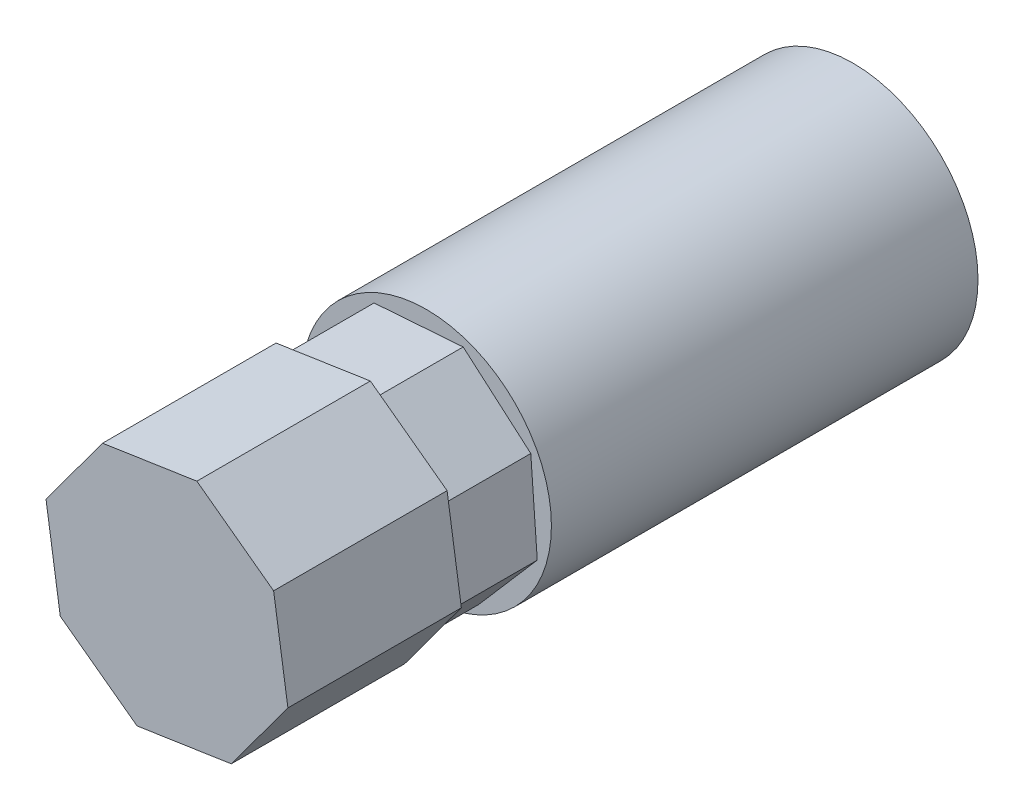
ISO-10303-21;
HEADER;
FILE_DESCRIPTION(('STEP AP214'),'2;1');
FILE_NAME('part.step','',(''),(''),'','','');
FILE_SCHEMA(('AUTOMOTIVE_DESIGN { 1 0 10303 214 1 1 1 1 }'));
ENDSEC;
DATA;
#1=APPLICATION_CONTEXT('core data for automotive mechanical design processes');
#2=APPLICATION_PROTOCOL_DEFINITION('international standard','automotive_design',2000,#1);
#3=PRODUCT_CONTEXT('',#1,'mechanical');
#4=PRODUCT('Part','Part','',(#3));
#5=PRODUCT_RELATED_PRODUCT_CATEGORY('part','',(#4));
#6=PRODUCT_DEFINITION_FORMATION('','',#4);
#7=PRODUCT_DEFINITION_CONTEXT('part definition',#1,'design');
#8=PRODUCT_DEFINITION('design','',#6,#7);
#9=PRODUCT_DEFINITION_SHAPE('','',#8);
#10=(LENGTH_UNIT() NAMED_UNIT(*) SI_UNIT(.MILLI.,.METRE.));
#11=(NAMED_UNIT(*) PLANE_ANGLE_UNIT() SI_UNIT($,.RADIAN.));
#12=(NAMED_UNIT(*) SI_UNIT($,.STERADIAN.) SOLID_ANGLE_UNIT());
#13=UNCERTAINTY_MEASURE_WITH_UNIT(LENGTH_MEASURE(1.E-05),#10,'distance_accuracy_value','');
#14=(GEOMETRIC_REPRESENTATION_CONTEXT(3) GLOBAL_UNCERTAINTY_ASSIGNED_CONTEXT((#13)) GLOBAL_UNIT_ASSIGNED_CONTEXT((#10,
#11,#12)) REPRESENTATION_CONTEXT('',''));
#15=CARTESIAN_POINT('',(0.,0.,0.));
#16=DIRECTION('',(0.,0.,1.));
#17=DIRECTION('',(1.,0.,0.));
#18=AXIS2_PLACEMENT_3D('',#15,#16,#17);
#19=CARTESIAN_POINT('',(0.,0.,15.367));
#20=DIRECTION('',(0.,0.,1.));
#21=DIRECTION('',(1.,0.,0.));
#22=AXIS2_PLACEMENT_3D('',#19,#20,#21);
#23=PLANE('',#22);
#24=CARTESIAN_POINT('',(0.,0.,15.367));
#25=DIRECTION('',(0.,0.,1.));
#26=DIRECTION('',(1.,0.,0.));
#27=AXIS2_PLACEMENT_3D('',#24,#25,#26);
#28=CIRCLE('',#27,4.50215);
#29=CARTESIAN_POINT('',(4.50215,0.,15.367));
#30=VERTEX_POINT('',#29);
#31=EDGE_CURVE('E11',#30,#30,#28,.T.);
#32=ORIENTED_EDGE('',*,*,#31,.T.);
#33=EDGE_LOOP('',(#32));
#34=FACE_BOUND('',#33,.T.);
#35=DIRECTION('',(-0.654043060694388,-0.756457318529947,0.));
#36=VECTOR('',#35,1.);
#37=CARTESIAN_POINT('',(-1.88692036380454,3.75942415581379,15.367));
#38=LINE('',#37,#36);
#39=CARTESIAN_POINT('',(-1.88692036380454,3.75942415581379,15.367));
#40=VERTEX_POINT('',#39);
#41=CARTESIAN_POINT('',(-3.99256849873762,1.32406012912727,15.367));
#42=VERTEX_POINT('',#41);
#43=EDGE_CURVE('E143',#40,#42,#38,.T.);
#44=ORIENTED_EDGE('',*,*,#43,.F.);
#45=DIRECTION('',(-0.997374383015724,-0.072417816205711,0.));
#46=VECTOR('',#45,1.);
#47=CARTESIAN_POINT('',(1.32406012912727,3.99256849873762,15.367));
#48=LINE('',#47,#46);
#49=CARTESIAN_POINT('',(1.32406012912727,3.99256849873762,15.367));
#50=VERTEX_POINT('',#49);
#51=EDGE_CURVE('E140',#50,#40,#48,.T.);
#52=ORIENTED_EDGE('',*,*,#51,.F.);
#53=DIRECTION('',(-0.756457318529947,0.654043060694388,0.));
#54=VECTOR('',#53,1.);
#55=CARTESIAN_POINT('',(3.75942415581379,1.88692036380454,15.367));
#56=LINE('',#55,#54);
#57=CARTESIAN_POINT('',(3.75942415581379,1.88692036380454,15.367));
#58=VERTEX_POINT('',#57);
#59=EDGE_CURVE('E81',#58,#50,#56,.T.);
#60=ORIENTED_EDGE('',*,*,#59,.F.);
#61=DIRECTION('',(-0.0724178162057107,0.997374383015724,0.));
#62=VECTOR('',#61,1.);
#63=CARTESIAN_POINT('',(3.99256849873762,-1.32406012912727,15.367));
#64=LINE('',#63,#62);
#65=CARTESIAN_POINT('',(3.99256849873762,-1.32406012912727,15.367));
#66=VERTEX_POINT('',#65);
#67=EDGE_CURVE('E153',#66,#58,#64,.T.);
#68=ORIENTED_EDGE('',*,*,#67,.F.);
#69=DIRECTION('',(0.654043060694388,0.756457318529947,0.));
#70=VECTOR('',#69,1.);
#71=CARTESIAN_POINT('',(1.88692036380454,-3.75942415581379,15.367));
#72=LINE('',#71,#70);
#73=CARTESIAN_POINT('',(1.88692036380454,-3.75942415581379,15.367));
#74=VERTEX_POINT('',#73);
#75=EDGE_CURVE('E151',#74,#66,#72,.T.);
#76=ORIENTED_EDGE('',*,*,#75,.F.);
#77=DIRECTION('',(0.997374383015724,0.0724178162057111,0.));
#78=VECTOR('',#77,1.);
#79=CARTESIAN_POINT('',(-1.32406012912727,-3.99256849873762,15.367));
#80=LINE('',#79,#78);
#81=CARTESIAN_POINT('',(-1.32406012912727,-3.99256849873762,15.367));
#82=VERTEX_POINT('',#81);
#83=EDGE_CURVE('E112',#82,#74,#80,.T.);
#84=ORIENTED_EDGE('',*,*,#83,.F.);
#85=DIRECTION('',(0.756457318529947,-0.654043060694388,0.));
#86=VECTOR('',#85,1.);
#87=CARTESIAN_POINT('',(-3.75942415581379,-1.88692036380454,15.367));
#88=LINE('',#87,#86);
#89=CARTESIAN_POINT('',(-3.75942415581379,-1.88692036380454,15.367));
#90=VERTEX_POINT('',#89);
#91=EDGE_CURVE('E148',#90,#82,#88,.T.);
#92=ORIENTED_EDGE('',*,*,#91,.F.);
#93=DIRECTION('',(0.0724178162057112,-0.997374383015724,0.));
#94=VECTOR('',#93,1.);
#95=CARTESIAN_POINT('',(-3.99256849873762,1.32406012912727,15.367));
#96=LINE('',#95,#94);
#97=EDGE_CURVE('E146',#42,#90,#96,.T.);
#98=ORIENTED_EDGE('',*,*,#97,.F.);
#99=EDGE_LOOP('',(#44,#52,#60,#68,#76,#84,#92,#98));
#100=FACE_BOUND('',#99,.T.);
#101=ADVANCED_FACE('F33',(#34,#100),#23,.T.);
#102=CARTESIAN_POINT('',(0.,0.,0.));
#103=DIRECTION('',(0.,0.,1.));
#104=DIRECTION('',(1.,0.,0.));
#105=AXIS2_PLACEMENT_3D('',#102,#103,#104);
#106=PLANE('',#105);
#107=CARTESIAN_POINT('',(0.,0.,0.));
#108=DIRECTION('',(0.,0.,1.));
#109=DIRECTION('',(1.,0.,0.));
#110=AXIS2_PLACEMENT_3D('',#107,#108,#109);
#111=CIRCLE('',#110,4.50215);
#112=CARTESIAN_POINT('',(4.50215,0.,0.));
#113=VERTEX_POINT('',#112);
#114=EDGE_CURVE('E37',#113,#113,#111,.T.);
#115=ORIENTED_EDGE('',*,*,#114,.F.);
#116=EDGE_LOOP('',(#115));
#117=FACE_BOUND('',#116,.T.);
#118=CARTESIAN_POINT('',(0.,0.,0.));
#119=DIRECTION('',(0.,0.,1.));
#120=DIRECTION('',(1.,0.,0.));
#121=AXIS2_PLACEMENT_3D('',#118,#119,#120);
#122=CIRCLE('',#121,3.1115);
#123=CARTESIAN_POINT('',(3.1115,0.,0.));
#124=VERTEX_POINT('',#123);
#125=EDGE_CURVE('E172',#124,#124,#122,.T.);
#126=ORIENTED_EDGE('',*,*,#125,.T.);
#127=EDGE_LOOP('',(#126));
#128=FACE_BOUND('',#127,.T.);
#129=ADVANCED_FACE('F180',(#117,#128),#106,.F.);
#130=CARTESIAN_POINT('',(0.,0.,15.367));
#131=DIRECTION('',(0.,0.,-1.));
#132=DIRECTION('',(-1.,0.,0.));
#133=AXIS2_PLACEMENT_3D('',#130,#131,#132);
#134=CYLINDRICAL_SURFACE('',#133,4.50215);
#135=ORIENTED_EDGE('',*,*,#31,.F.);
#136=EDGE_LOOP('',(#135));
#137=FACE_BOUND('',#136,.T.);
#138=ORIENTED_EDGE('',*,*,#114,.T.);
#139=EDGE_LOOP('',(#138));
#140=FACE_BOUND('',#139,.T.);
#141=ADVANCED_FACE('F35',(#137,#140),#134,.T.);
#142=CARTESIAN_POINT('',(0.,0.,15.367));
#143=DIRECTION('',(0.,0.,-1.));
#144=DIRECTION('',(-1.,0.,0.));
#145=AXIS2_PLACEMENT_3D('',#142,#143,#144);
#146=CYLINDRICAL_SURFACE('',#145,3.1115);
#147=CARTESIAN_POINT('',(0.,0.,15.367));
#148=DIRECTION('',(0.,0.,1.));
#149=DIRECTION('',(1.,0.,0.));
#150=AXIS2_PLACEMENT_3D('',#147,#148,#149);
#151=CIRCLE('',#150,3.1115);
#152=CARTESIAN_POINT('',(3.1115,0.,15.367));
#153=VERTEX_POINT('',#152);
#154=EDGE_CURVE('E169',#153,#153,#151,.T.);
#155=ORIENTED_EDGE('',*,*,#154,.T.);
#156=EDGE_LOOP('',(#155));
#157=FACE_BOUND('',#156,.T.);
#158=ORIENTED_EDGE('',*,*,#125,.F.);
#159=EDGE_LOOP('',(#158));
#160=FACE_BOUND('',#159,.T.);
#161=ADVANCED_FACE('F186',(#157,#160),#146,.F.);
#162=CARTESIAN_POINT('',(0.,0.,15.367));
#163=DIRECTION('',(0.,0.,1.));
#164=DIRECTION('',(1.,0.,0.));
#165=AXIS2_PLACEMENT_3D('',#162,#163,#164);
#166=PLANE('',#165);
#167=ORIENTED_EDGE('',*,*,#154,.F.);
#168=EDGE_LOOP('',(#167));
#169=FACE_BOUND('',#168,.T.);
#170=ADVANCED_FACE('F193',(#169),#166,.F.);
#171=CARTESIAN_POINT('',(1.32406012912727,3.99256849873762,18.4658));
#172=DIRECTION('',(0.072417816205711,-0.997374383015724,0.));
#173=DIRECTION('',(0.997374383015724,0.072417816205711,0.));
#174=AXIS2_PLACEMENT_3D('',#171,#172,#173);
#175=PLANE('',#174);
#176=ORIENTED_EDGE('',*,*,#51,.T.);
#177=DIRECTION('',(0.,0.,-1.));
#178=VECTOR('',#177,1.);
#179=CARTESIAN_POINT('',(-1.88692036380454,3.75942415581379,18.4658));
#180=LINE('',#179,#178);
#181=CARTESIAN_POINT('',(-1.88692036380454,3.75942415581379,18.4658));
#182=VERTEX_POINT('',#181);
#183=EDGE_CURVE('E167',#182,#40,#180,.T.);
#184=ORIENTED_EDGE('',*,*,#183,.F.);
#185=DIRECTION('',(-0.997374383015724,-0.072417816205711,0.));
#186=VECTOR('',#185,1.);
#187=CARTESIAN_POINT('',(1.32406012912727,3.99256849873762,18.4658));
#188=LINE('',#187,#186);
#189=CARTESIAN_POINT('',(1.32406012912727,3.99256849873762,18.4658));
#190=VERTEX_POINT('',#189);
#191=EDGE_CURVE('E156',#190,#182,#188,.T.);
#192=ORIENTED_EDGE('',*,*,#191,.F.);
#193=DIRECTION('',(0.,0.,-1.));
#194=VECTOR('',#193,1.);
#195=CARTESIAN_POINT('',(1.32406012912727,3.99256849873762,18.4658));
#196=LINE('',#195,#194);
#197=EDGE_CURVE('E139',#190,#50,#196,.T.);
#198=ORIENTED_EDGE('',*,*,#197,.T.);
#199=EDGE_LOOP('',(#176,#184,#192,#198));
#200=FACE_BOUND('',#199,.T.);
#201=ADVANCED_FACE('F195',(#200),#175,.F.);
#202=CARTESIAN_POINT('',(-1.88692036380454,3.75942415581379,18.4658));
#203=DIRECTION('',(0.756457318529947,-0.654043060694388,0.));
#204=DIRECTION('',(0.654043060694388,0.756457318529947,0.));
#205=AXIS2_PLACEMENT_3D('',#202,#203,#204);
#206=PLANE('',#205);
#207=ORIENTED_EDGE('',*,*,#43,.T.);
#208=DIRECTION('',(0.,0.,-1.));
#209=VECTOR('',#208,1.);
#210=CARTESIAN_POINT('',(-3.99256849873762,1.32406012912727,18.4658));
#211=LINE('',#210,#209);
#212=CARTESIAN_POINT('',(-3.99256849873762,1.32406012912727,18.4658));
#213=VERTEX_POINT('',#212);
#214=EDGE_CURVE('E164',#213,#42,#211,.T.);
#215=ORIENTED_EDGE('',*,*,#214,.F.);
#216=DIRECTION('',(-0.654043060694388,-0.756457318529947,0.));
#217=VECTOR('',#216,1.);
#218=CARTESIAN_POINT('',(-1.88692036380454,3.75942415581379,18.4658));
#219=LINE('',#218,#217);
#220=EDGE_CURVE('E89',#182,#213,#219,.T.);
#221=ORIENTED_EDGE('',*,*,#220,.F.);
#222=ORIENTED_EDGE('',*,*,#183,.T.);
#223=EDGE_LOOP('',(#207,#215,#221,#222));
#224=FACE_BOUND('',#223,.T.);
#225=ADVANCED_FACE('F198',(#224),#206,.F.);
#226=CARTESIAN_POINT('',(-3.99256849873762,1.32406012912727,18.4658));
#227=DIRECTION('',(0.997374383015724,0.0724178162057113,0.));
#228=DIRECTION('',(-0.0724178162057113,0.997374383015724,0.));
#229=AXIS2_PLACEMENT_3D('',#226,#227,#228);
#230=PLANE('',#229);
#231=ORIENTED_EDGE('',*,*,#97,.T.);
#232=DIRECTION('',(0.,0.,-1.));
#233=VECTOR('',#232,1.);
#234=CARTESIAN_POINT('',(-3.75942415581379,-1.88692036380454,18.4658));
#235=LINE('',#234,#233);
#236=CARTESIAN_POINT('',(-3.75942415581379,-1.88692036380454,18.4658));
#237=VERTEX_POINT('',#236);
#238=EDGE_CURVE('E161',#237,#90,#235,.T.);
#239=ORIENTED_EDGE('',*,*,#238,.F.);
#240=DIRECTION('',(0.0724178162057112,-0.997374383015724,0.));
#241=VECTOR('',#240,1.);
#242=CARTESIAN_POINT('',(-3.99256849873762,1.32406012912727,18.4658));
#243=LINE('',#242,#241);
#244=EDGE_CURVE('E132',#213,#237,#243,.T.);
#245=ORIENTED_EDGE('',*,*,#244,.F.);
#246=ORIENTED_EDGE('',*,*,#214,.T.);
#247=EDGE_LOOP('',(#231,#239,#245,#246));
#248=FACE_BOUND('',#247,.T.);
#249=ADVANCED_FACE('F202',(#248),#230,.F.);
#250=CARTESIAN_POINT('',(-3.75942415581379,-1.88692036380454,18.4658));
#251=DIRECTION('',(0.654043060694388,0.756457318529947,0.));
#252=DIRECTION('',(-0.756457318529947,0.654043060694388,0.));
#253=AXIS2_PLACEMENT_3D('',#250,#251,#252);
#254=PLANE('',#253);
#255=ORIENTED_EDGE('',*,*,#91,.T.);
#256=DIRECTION('',(0.,0.,-1.));
#257=VECTOR('',#256,1.);
#258=CARTESIAN_POINT('',(-1.32406012912727,-3.99256849873762,18.4658));
#259=LINE('',#258,#257);
#260=CARTESIAN_POINT('',(-1.32406012912727,-3.99256849873762,18.4658));
#261=VERTEX_POINT('',#260);
#262=EDGE_CURVE('E115',#261,#82,#259,.T.);
#263=ORIENTED_EDGE('',*,*,#262,.F.);
#264=DIRECTION('',(0.756457318529947,-0.654043060694388,0.));
#265=VECTOR('',#264,1.);
#266=CARTESIAN_POINT('',(-3.75942415581379,-1.88692036380454,18.4658));
#267=LINE('',#266,#265);
#268=EDGE_CURVE('E130',#237,#261,#267,.T.);
#269=ORIENTED_EDGE('',*,*,#268,.F.);
#270=ORIENTED_EDGE('',*,*,#238,.T.);
#271=EDGE_LOOP('',(#255,#263,#269,#270));
#272=FACE_BOUND('',#271,.T.);
#273=ADVANCED_FACE('F205',(#272),#254,.F.);
#274=CARTESIAN_POINT('',(-1.32406012912727,-3.99256849873762,18.4658));
#275=DIRECTION('',(-0.0724178162057111,0.997374383015724,0.));
#276=DIRECTION('',(-0.997374383015724,-0.0724178162057111,0.));
#277=AXIS2_PLACEMENT_3D('',#274,#275,#276);
#278=PLANE('',#277);
#279=ORIENTED_EDGE('',*,*,#83,.T.);
#280=DIRECTION('',(0.,0.,-1.));
#281=VECTOR('',#280,1.);
#282=CARTESIAN_POINT('',(1.88692036380454,-3.75942415581379,18.4658));
#283=LINE('',#282,#281);
#284=CARTESIAN_POINT('',(1.88692036380454,-3.75942415581379,18.4658));
#285=VERTEX_POINT('',#284);
#286=EDGE_CURVE('E104',#285,#74,#283,.T.);
#287=ORIENTED_EDGE('',*,*,#286,.F.);
#288=DIRECTION('',(0.997374383015724,0.0724178162057111,0.));
#289=VECTOR('',#288,1.);
#290=CARTESIAN_POINT('',(-1.32406012912727,-3.99256849873762,18.4658));
#291=LINE('',#290,#289);
#292=EDGE_CURVE('E109',#261,#285,#291,.T.);
#293=ORIENTED_EDGE('',*,*,#292,.F.);
#294=ORIENTED_EDGE('',*,*,#262,.T.);
#295=EDGE_LOOP('',(#279,#287,#293,#294));
#296=FACE_BOUND('',#295,.T.);
#297=ADVANCED_FACE('F106',(#296),#278,.F.);
#298=CARTESIAN_POINT('',(1.88692036380454,-3.75942415581379,18.4658));
#299=DIRECTION('',(-0.756457318529947,0.654043060694388,0.));
#300=DIRECTION('',(-0.654043060694388,-0.756457318529947,0.));
#301=AXIS2_PLACEMENT_3D('',#298,#299,#300);
#302=PLANE('',#301);
#303=ORIENTED_EDGE('',*,*,#75,.T.);
#304=DIRECTION('',(0.,0.,-1.));
#305=VECTOR('',#304,1.);
#306=CARTESIAN_POINT('',(3.99256849873762,-1.32406012912727,18.4658));
#307=LINE('',#306,#305);
#308=CARTESIAN_POINT('',(3.99256849873762,-1.32406012912727,18.4658));
#309=VERTEX_POINT('',#308);
#310=EDGE_CURVE('E116',#309,#66,#307,.T.);
#311=ORIENTED_EDGE('',*,*,#310,.F.);
#312=DIRECTION('',(0.654043060694388,0.756457318529947,0.));
#313=VECTOR('',#312,1.);
#314=CARTESIAN_POINT('',(1.88692036380454,-3.75942415581379,18.4658));
#315=LINE('',#314,#313);
#316=EDGE_CURVE('E119',#285,#309,#315,.T.);
#317=ORIENTED_EDGE('',*,*,#316,.F.);
#318=ORIENTED_EDGE('',*,*,#286,.T.);
#319=EDGE_LOOP('',(#303,#311,#317,#318));
#320=FACE_BOUND('',#319,.T.);
#321=ADVANCED_FACE('F120',(#320),#302,.F.);
#322=CARTESIAN_POINT('',(3.99256849873762,-1.32406012912727,18.4658));
#323=DIRECTION('',(-0.997374383015724,-0.0724178162057107,0.));
#324=DIRECTION('',(0.0724178162057107,-0.997374383015724,0.));
#325=AXIS2_PLACEMENT_3D('',#322,#323,#324);
#326=PLANE('',#325);
#327=ORIENTED_EDGE('',*,*,#67,.T.);
#328=DIRECTION('',(0.,0.,-1.));
#329=VECTOR('',#328,1.);
#330=CARTESIAN_POINT('',(3.75942415581379,1.88692036380454,18.4658));
#331=LINE('',#330,#329);
#332=CARTESIAN_POINT('',(3.75942415581379,1.88692036380454,18.4658));
#333=VERTEX_POINT('',#332);
#334=EDGE_CURVE('E48',#333,#58,#331,.T.);
#335=ORIENTED_EDGE('',*,*,#334,.F.);
#336=DIRECTION('',(-0.0724178162057107,0.997374383015724,0.));
#337=VECTOR('',#336,1.);
#338=CARTESIAN_POINT('',(3.99256849873762,-1.32406012912727,18.4658));
#339=LINE('',#338,#337);
#340=EDGE_CURVE('E124',#309,#333,#339,.T.);
#341=ORIENTED_EDGE('',*,*,#340,.F.);
#342=ORIENTED_EDGE('',*,*,#310,.T.);
#343=EDGE_LOOP('',(#327,#335,#341,#342));
#344=FACE_BOUND('',#343,.T.);
#345=ADVANCED_FACE('F214',(#344),#326,.F.);
#346=CARTESIAN_POINT('',(3.75942415581379,1.88692036380454,18.4658));
#347=DIRECTION('',(-0.654043060694388,-0.756457318529947,0.));
#348=DIRECTION('',(0.756457318529947,-0.654043060694388,0.));
#349=AXIS2_PLACEMENT_3D('',#346,#347,#348);
#350=PLANE('',#349);
#351=ORIENTED_EDGE('',*,*,#59,.T.);
#352=ORIENTED_EDGE('',*,*,#197,.F.);
#353=DIRECTION('',(-0.756457318529947,0.654043060694388,0.));
#354=VECTOR('',#353,1.);
#355=CARTESIAN_POINT('',(3.75942415581379,1.88692036380454,18.4658));
#356=LINE('',#355,#354);
#357=EDGE_CURVE('E137',#333,#190,#356,.T.);
#358=ORIENTED_EDGE('',*,*,#357,.F.);
#359=ORIENTED_EDGE('',*,*,#334,.T.);
#360=EDGE_LOOP('',(#351,#352,#358,#359));
#361=FACE_BOUND('',#360,.T.);
#362=ADVANCED_FACE('F217',(#361),#350,.F.);
#363=CARTESIAN_POINT('',(0.,0.,18.4658));
#364=DIRECTION('',(0.,0.,1.));
#365=DIRECTION('',(1.,0.,0.));
#366=AXIS2_PLACEMENT_3D('',#363,#364,#365);
#367=PLANE('',#366);
#368=DIRECTION('',(-0.98875069559291,-0.149572931924654,0.));
#369=VECTOR('',#368,1.);
#370=CARTESIAN_POINT('',(1.07802428187722,4.35680427000171,18.4658));
#371=LINE('',#370,#369);
#372=CARTESIAN_POINT('',(1.07802428187722,4.35680427000171,18.4658));
#373=VERTEX_POINT('',#372);
#374=CARTESIAN_POINT('',(-2.31844756362157,3.84300412361985,18.4658));
#375=VERTEX_POINT('',#374);
#376=EDGE_CURVE('E289',#373,#375,#371,.T.);
#377=ORIENTED_EDGE('',*,*,#376,.F.);
#378=DIRECTION('',(-0.804916356202539,0.593388287310785,0.));
#379=VECTOR('',#378,1.);
#380=CARTESIAN_POINT('',(3.84300412361985,2.31844756362157,18.4658));
#381=LINE('',#380,#379);
#382=CARTESIAN_POINT('',(3.84300412361985,2.31844756362157,18.4658));
#383=VERTEX_POINT('',#382);
#384=EDGE_CURVE('E283',#383,#373,#381,.T.);
#385=ORIENTED_EDGE('',*,*,#384,.F.);
#386=DIRECTION('',(-0.149572931924655,0.98875069559291,0.));
#387=VECTOR('',#386,1.);
#388=CARTESIAN_POINT('',(4.35680427000171,-1.07802428187722,18.4658));
#389=LINE('',#388,#387);
#390=CARTESIAN_POINT('',(4.35680427000171,-1.07802428187722,18.4658));
#391=VERTEX_POINT('',#390);
#392=EDGE_CURVE('E339',#391,#383,#389,.T.);
#393=ORIENTED_EDGE('',*,*,#392,.F.);
#394=DIRECTION('',(0.593388287310786,0.804916356202539,0.));
#395=VECTOR('',#394,1.);
#396=CARTESIAN_POINT('',(2.31844756362157,-3.84300412361985,18.4658));
#397=LINE('',#396,#395);
#398=CARTESIAN_POINT('',(2.31844756362157,-3.84300412361985,18.4658));
#399=VERTEX_POINT('',#398);
#400=EDGE_CURVE('E355',#399,#391,#397,.T.);
#401=ORIENTED_EDGE('',*,*,#400,.F.);
#402=DIRECTION('',(0.98875069559291,0.149572931924654,0.));
#403=VECTOR('',#402,1.);
#404=CARTESIAN_POINT('',(-1.07802428187722,-4.35680427000171,18.4658));
#405=LINE('',#404,#403);
#406=CARTESIAN_POINT('',(-1.07802428187722,-4.35680427000171,18.4658));
#407=VERTEX_POINT('',#406);
#408=EDGE_CURVE('E353',#407,#399,#405,.T.);
#409=ORIENTED_EDGE('',*,*,#408,.F.);
#410=DIRECTION('',(0.804916356202539,-0.593388287310785,0.));
#411=VECTOR('',#410,1.);
#412=CARTESIAN_POINT('',(-3.84300412361985,-2.31844756362157,18.4658));
#413=LINE('',#412,#411);
#414=CARTESIAN_POINT('',(-3.84300412361985,-2.31844756362157,18.4658));
#415=VERTEX_POINT('',#414);
#416=EDGE_CURVE('E351',#415,#407,#413,.T.);
#417=ORIENTED_EDGE('',*,*,#416,.F.);
#418=DIRECTION('',(0.149572931924654,-0.98875069559291,0.));
#419=VECTOR('',#418,1.);
#420=CARTESIAN_POINT('',(-4.35680427000171,1.07802428187722,18.4658));
#421=LINE('',#420,#419);
#422=CARTESIAN_POINT('',(-4.35680427000171,1.07802428187722,18.4658));
#423=VERTEX_POINT('',#422);
#424=EDGE_CURVE('E345',#423,#415,#421,.T.);
#425=ORIENTED_EDGE('',*,*,#424,.F.);
#426=DIRECTION('',(-0.593388287310785,-0.804916356202539,0.));
#427=VECTOR('',#426,1.);
#428=CARTESIAN_POINT('',(-2.31844756362157,3.84300412361985,18.4658));
#429=LINE('',#428,#427);
#430=EDGE_CURVE('E343',#375,#423,#429,.T.);
#431=ORIENTED_EDGE('',*,*,#430,.F.);
#432=EDGE_LOOP('',(#377,#385,#393,#401,#409,#417,#425,#431));
#433=FACE_BOUND('',#432,.T.);
#434=ORIENTED_EDGE('',*,*,#357,.T.);
#435=ORIENTED_EDGE('',*,*,#191,.T.);
#436=ORIENTED_EDGE('',*,*,#220,.T.);
#437=ORIENTED_EDGE('',*,*,#244,.T.);
#438=ORIENTED_EDGE('',*,*,#268,.T.);
#439=ORIENTED_EDGE('',*,*,#292,.T.);
#440=ORIENTED_EDGE('',*,*,#316,.T.);
#441=ORIENTED_EDGE('',*,*,#340,.T.);
#442=EDGE_LOOP('',(#434,#435,#436,#437,#438,#439,#440,#441));
#443=FACE_BOUND('',#442,.T.);
#444=ADVANCED_FACE('F127',(#433,#443),#367,.F.);
#445=CARTESIAN_POINT('',(1.07802428187722,4.35680427000171,24.7142));
#446=DIRECTION('',(0.149572931924654,-0.98875069559291,0.));
#447=DIRECTION('',(0.98875069559291,0.149572931924654,0.));
#448=AXIS2_PLACEMENT_3D('',#445,#446,#447);
#449=PLANE('',#448);
#450=ORIENTED_EDGE('',*,*,#376,.T.);
#451=DIRECTION('',(0.,0.,-1.));
#452=VECTOR('',#451,1.);
#453=CARTESIAN_POINT('',(-2.31844756362157,3.84300412361985,24.7142));
#454=LINE('',#453,#452);
#455=CARTESIAN_POINT('',(-2.31844756362157,3.84300412361985,24.7142));
#456=VERTEX_POINT('',#455);
#457=EDGE_CURVE('E144',#456,#375,#454,.T.);
#458=ORIENTED_EDGE('',*,*,#457,.F.);
#459=DIRECTION('',(-0.98875069559291,-0.149572931924654,0.));
#460=VECTOR('',#459,1.);
#461=CARTESIAN_POINT('',(1.07802428187722,4.35680427000171,24.7142));
#462=LINE('',#461,#460);
#463=CARTESIAN_POINT('',(1.07802428187722,4.35680427000171,24.7142));
#464=VERTEX_POINT('',#463);
#465=EDGE_CURVE('E268',#464,#456,#462,.T.);
#466=ORIENTED_EDGE('',*,*,#465,.F.);
#467=DIRECTION('',(0.,0.,-1.));
#468=VECTOR('',#467,1.);
#469=CARTESIAN_POINT('',(1.07802428187722,4.35680427000171,24.7142));
#470=LINE('',#469,#468);
#471=EDGE_CURVE('E335',#464,#373,#470,.T.);
#472=ORIENTED_EDGE('',*,*,#471,.T.);
#473=EDGE_LOOP('',(#450,#458,#466,#472));
#474=FACE_BOUND('',#473,.T.);
#475=ADVANCED_FACE('F223',(#474),#449,.F.);
#476=CARTESIAN_POINT('',(-2.31844756362157,3.84300412361985,24.7142));
#477=DIRECTION('',(0.804916356202539,-0.593388287310785,0.));
#478=DIRECTION('',(0.593388287310785,0.804916356202539,0.));
#479=AXIS2_PLACEMENT_3D('',#476,#477,#478);
#480=PLANE('',#479);
#481=ORIENTED_EDGE('',*,*,#430,.T.);
#482=DIRECTION('',(0.,0.,-1.));
#483=VECTOR('',#482,1.);
#484=CARTESIAN_POINT('',(-4.35680427000171,1.07802428187722,24.7142));
#485=LINE('',#484,#483);
#486=CARTESIAN_POINT('',(-4.35680427000171,1.07802428187722,24.7142));
#487=VERTEX_POINT('',#486);
#488=EDGE_CURVE('E291',#487,#423,#485,.T.);
#489=ORIENTED_EDGE('',*,*,#488,.F.);
#490=DIRECTION('',(-0.593388287310785,-0.804916356202539,0.));
#491=VECTOR('',#490,1.);
#492=CARTESIAN_POINT('',(-2.31844756362157,3.84300412361985,24.7142));
#493=LINE('',#492,#491);
#494=EDGE_CURVE('E273',#456,#487,#493,.T.);
#495=ORIENTED_EDGE('',*,*,#494,.F.);
#496=ORIENTED_EDGE('',*,*,#457,.T.);
#497=EDGE_LOOP('',(#481,#489,#495,#496));
#498=FACE_BOUND('',#497,.T.);
#499=ADVANCED_FACE('F226',(#498),#480,.F.);
#500=CARTESIAN_POINT('',(-4.35680427000171,1.07802428187722,24.7142));
#501=DIRECTION('',(0.98875069559291,0.149572931924654,0.));
#502=DIRECTION('',(-0.149572931924654,0.98875069559291,0.));
#503=AXIS2_PLACEMENT_3D('',#500,#501,#502);
#504=PLANE('',#503);
#505=ORIENTED_EDGE('',*,*,#424,.T.);
#506=DIRECTION('',(0.,0.,-1.));
#507=VECTOR('',#506,1.);
#508=CARTESIAN_POINT('',(-3.84300412361985,-2.31844756362157,24.7142));
#509=LINE('',#508,#507);
#510=CARTESIAN_POINT('',(-3.84300412361985,-2.31844756362157,24.7142));
#511=VERTEX_POINT('',#510);
#512=EDGE_CURVE('E294',#511,#415,#509,.T.);
#513=ORIENTED_EDGE('',*,*,#512,.F.);
#514=DIRECTION('',(0.149572931924654,-0.98875069559291,0.));
#515=VECTOR('',#514,1.);
#516=CARTESIAN_POINT('',(-4.35680427000171,1.07802428187722,24.7142));
#517=LINE('',#516,#515);
#518=EDGE_CURVE('E395',#487,#511,#517,.T.);
#519=ORIENTED_EDGE('',*,*,#518,.F.);
#520=ORIENTED_EDGE('',*,*,#488,.T.);
#521=EDGE_LOOP('',(#505,#513,#519,#520));
#522=FACE_BOUND('',#521,.T.);
#523=ADVANCED_FACE('F230',(#522),#504,.F.);
#524=CARTESIAN_POINT('',(-3.84300412361985,-2.31844756362157,24.7142));
#525=DIRECTION('',(0.593388287310786,0.804916356202539,0.));
#526=DIRECTION('',(-0.804916356202539,0.593388287310786,0.));
#527=AXIS2_PLACEMENT_3D('',#524,#525,#526);
#528=PLANE('',#527);
#529=ORIENTED_EDGE('',*,*,#416,.T.);
#530=DIRECTION('',(0.,0.,-1.));
#531=VECTOR('',#530,1.);
#532=CARTESIAN_POINT('',(-1.07802428187722,-4.35680427000171,24.7142));
#533=LINE('',#532,#531);
#534=CARTESIAN_POINT('',(-1.07802428187722,-4.35680427000171,24.7142));
#535=VERTEX_POINT('',#534);
#536=EDGE_CURVE('E365',#535,#407,#533,.T.);
#537=ORIENTED_EDGE('',*,*,#536,.F.);
#538=DIRECTION('',(0.804916356202539,-0.593388287310785,0.));
#539=VECTOR('',#538,1.);
#540=CARTESIAN_POINT('',(-3.84300412361985,-2.31844756362157,24.7142));
#541=LINE('',#540,#539);
#542=EDGE_CURVE('E374',#511,#535,#541,.T.);
#543=ORIENTED_EDGE('',*,*,#542,.F.);
#544=ORIENTED_EDGE('',*,*,#512,.T.);
#545=EDGE_LOOP('',(#529,#537,#543,#544));
#546=FACE_BOUND('',#545,.T.);
#547=ADVANCED_FACE('F234',(#546),#528,.F.);
#548=CARTESIAN_POINT('',(-1.07802428187722,-4.35680427000171,24.7142));
#549=DIRECTION('',(-0.149572931924654,0.98875069559291,0.));
#550=DIRECTION('',(-0.98875069559291,-0.149572931924654,0.));
#551=AXIS2_PLACEMENT_3D('',#548,#549,#550);
#552=PLANE('',#551);
#553=ORIENTED_EDGE('',*,*,#408,.T.);
#554=DIRECTION('',(0.,0.,-1.));
#555=VECTOR('',#554,1.);
#556=CARTESIAN_POINT('',(2.31844756362157,-3.84300412361985,24.7142));
#557=LINE('',#556,#555);
#558=CARTESIAN_POINT('',(2.31844756362157,-3.84300412361985,24.7142));
#559=VERTEX_POINT('',#558);
#560=EDGE_CURVE('E362',#559,#399,#557,.T.);
#561=ORIENTED_EDGE('',*,*,#560,.F.);
#562=DIRECTION('',(0.98875069559291,0.149572931924654,0.));
#563=VECTOR('',#562,1.);
#564=CARTESIAN_POINT('',(-1.07802428187722,-4.35680427000171,24.7142));
#565=LINE('',#564,#563);
#566=EDGE_CURVE('E390',#535,#559,#565,.T.);
#567=ORIENTED_EDGE('',*,*,#566,.F.);
#568=ORIENTED_EDGE('',*,*,#536,.T.);
#569=EDGE_LOOP('',(#553,#561,#567,#568));
#570=FACE_BOUND('',#569,.T.);
#571=ADVANCED_FACE('F238',(#570),#552,.F.);
#572=CARTESIAN_POINT('',(2.31844756362157,-3.84300412361985,24.7142));
#573=DIRECTION('',(-0.804916356202539,0.593388287310786,0.));
#574=DIRECTION('',(-0.593388287310786,-0.804916356202539,0.));
#575=AXIS2_PLACEMENT_3D('',#572,#573,#574);
#576=PLANE('',#575);
#577=ORIENTED_EDGE('',*,*,#400,.T.);
#578=DIRECTION('',(0.,0.,-1.));
#579=VECTOR('',#578,1.);
#580=CARTESIAN_POINT('',(4.35680427000171,-1.07802428187722,24.7142));
#581=LINE('',#580,#579);
#582=CARTESIAN_POINT('',(4.35680427000171,-1.07802428187722,24.7142));
#583=VERTEX_POINT('',#582);
#584=EDGE_CURVE('E359',#583,#391,#581,.T.);
#585=ORIENTED_EDGE('',*,*,#584,.F.);
#586=DIRECTION('',(0.593388287310786,0.804916356202539,0.));
#587=VECTOR('',#586,1.);
#588=CARTESIAN_POINT('',(2.31844756362157,-3.84300412361985,24.7142));
#589=LINE('',#588,#587);
#590=EDGE_CURVE('E384',#559,#583,#589,.T.);
#591=ORIENTED_EDGE('',*,*,#590,.F.);
#592=ORIENTED_EDGE('',*,*,#560,.T.);
#593=EDGE_LOOP('',(#577,#585,#591,#592));
#594=FACE_BOUND('',#593,.T.);
#595=ADVANCED_FACE('F242',(#594),#576,.F.);
#596=CARTESIAN_POINT('',(4.35680427000171,-1.07802428187722,24.7142));
#597=DIRECTION('',(-0.98875069559291,-0.149572931924655,0.));
#598=DIRECTION('',(0.149572931924655,-0.98875069559291,0.));
#599=AXIS2_PLACEMENT_3D('',#596,#597,#598);
#600=PLANE('',#599);
#601=ORIENTED_EDGE('',*,*,#392,.T.);
#602=DIRECTION('',(0.,0.,-1.));
#603=VECTOR('',#602,1.);
#604=CARTESIAN_POINT('',(3.84300412361985,2.31844756362157,24.7142));
#605=LINE('',#604,#603);
#606=CARTESIAN_POINT('',(3.84300412361985,2.31844756362157,24.7142));
#607=VERTEX_POINT('',#606);
#608=EDGE_CURVE('E337',#607,#383,#605,.T.);
#609=ORIENTED_EDGE('',*,*,#608,.F.);
#610=DIRECTION('',(-0.149572931924655,0.98875069559291,0.));
#611=VECTOR('',#610,1.);
#612=CARTESIAN_POINT('',(4.35680427000171,-1.07802428187722,24.7142));
#613=LINE('',#612,#611);
#614=EDGE_CURVE('E389',#583,#607,#613,.T.);
#615=ORIENTED_EDGE('',*,*,#614,.F.);
#616=ORIENTED_EDGE('',*,*,#584,.T.);
#617=EDGE_LOOP('',(#601,#609,#615,#616));
#618=FACE_BOUND('',#617,.T.);
#619=ADVANCED_FACE('F246',(#618),#600,.F.);
#620=CARTESIAN_POINT('',(3.84300412361985,2.31844756362157,24.7142));
#621=DIRECTION('',(-0.593388287310786,-0.804916356202539,0.));
#622=DIRECTION('',(0.804916356202539,-0.593388287310786,0.));
#623=AXIS2_PLACEMENT_3D('',#620,#621,#622);
#624=PLANE('',#623);
#625=ORIENTED_EDGE('',*,*,#384,.T.);
#626=ORIENTED_EDGE('',*,*,#471,.F.);
#627=DIRECTION('',(-0.804916356202539,0.593388287310785,0.));
#628=VECTOR('',#627,1.);
#629=CARTESIAN_POINT('',(3.84300412361985,2.31844756362157,24.7142));
#630=LINE('',#629,#628);
#631=EDGE_CURVE('E278',#607,#464,#630,.T.);
#632=ORIENTED_EDGE('',*,*,#631,.F.);
#633=ORIENTED_EDGE('',*,*,#608,.T.);
#634=EDGE_LOOP('',(#625,#626,#632,#633));
#635=FACE_BOUND('',#634,.T.);
#636=ADVANCED_FACE('F250',(#635),#624,.F.);
#637=CARTESIAN_POINT('',(0.,0.,24.7142));
#638=DIRECTION('',(0.,0.,1.));
#639=DIRECTION('',(1.,0.,0.));
#640=AXIS2_PLACEMENT_3D('',#637,#638,#639);
#641=PLANE('',#640);
#642=ORIENTED_EDGE('',*,*,#465,.T.);
#643=ORIENTED_EDGE('',*,*,#494,.T.);
#644=ORIENTED_EDGE('',*,*,#518,.T.);
#645=ORIENTED_EDGE('',*,*,#542,.T.);
#646=ORIENTED_EDGE('',*,*,#566,.T.);
#647=ORIENTED_EDGE('',*,*,#590,.T.);
#648=ORIENTED_EDGE('',*,*,#614,.T.);
#649=ORIENTED_EDGE('',*,*,#631,.T.);
#650=EDGE_LOOP('',(#642,#643,#644,#645,#646,#647,#648,#649));
#651=FACE_BOUND('',#650,.T.);
#652=ADVANCED_FACE('F254',(#651),#641,.T.);
#653=CLOSED_SHELL('',(#101,#129,#141,#161,#170,#201,#225,#249,#273,#297,#321,#345,#362,#444,
#475,#499,#523,#547,#571,#595,#619,#636,#652));
#654=MANIFOLD_SOLID_BREP('B2',#653);
#655=ADVANCED_BREP_SHAPE_REPRESENTATION('',(#18,#654),#14);
#656=SHAPE_DEFINITION_REPRESENTATION(#9,#655);
ENDSEC;
END-ISO-10303-21;
